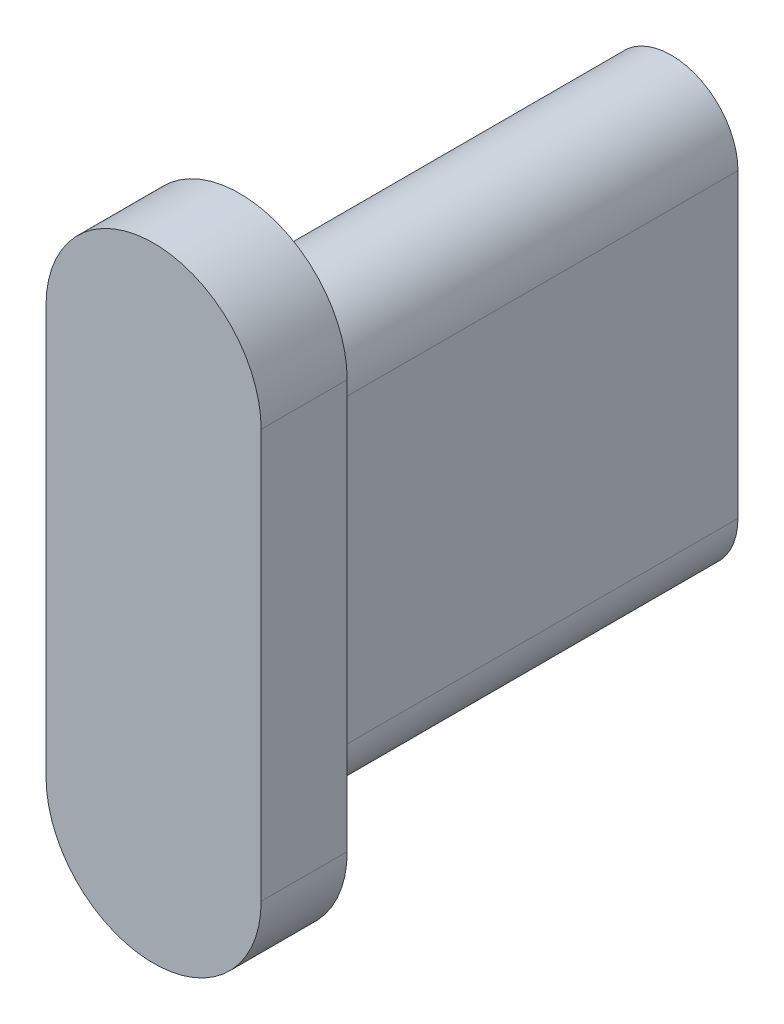
ISO-10303-21;
HEADER;
FILE_DESCRIPTION(('STEP AP214'),'2;1');
FILE_NAME('part.step','',(''),(''),'','','');
FILE_SCHEMA(('AUTOMOTIVE_DESIGN { 1 0 10303 214 1 1 1 1 }'));
ENDSEC;
DATA;
#1=APPLICATION_CONTEXT('core data for automotive mechanical design processes');
#2=APPLICATION_PROTOCOL_DEFINITION('international standard','automotive_design',2000,#1);
#3=PRODUCT_CONTEXT('',#1,'mechanical');
#4=PRODUCT('Part','Part','',(#3));
#5=PRODUCT_RELATED_PRODUCT_CATEGORY('part','',(#4));
#6=PRODUCT_DEFINITION_FORMATION('','',#4);
#7=PRODUCT_DEFINITION_CONTEXT('part definition',#1,'design');
#8=PRODUCT_DEFINITION('design','',#6,#7);
#9=PRODUCT_DEFINITION_SHAPE('','',#8);
#10=(LENGTH_UNIT() NAMED_UNIT(*) SI_UNIT(.MILLI.,.METRE.));
#11=(NAMED_UNIT(*) PLANE_ANGLE_UNIT() SI_UNIT($,.RADIAN.));
#12=(NAMED_UNIT(*) SI_UNIT($,.STERADIAN.) SOLID_ANGLE_UNIT());
#13=UNCERTAINTY_MEASURE_WITH_UNIT(LENGTH_MEASURE(1.E-05),#10,'distance_accuracy_value','');
#14=(GEOMETRIC_REPRESENTATION_CONTEXT(3) GLOBAL_UNCERTAINTY_ASSIGNED_CONTEXT((#13)) GLOBAL_UNIT_ASSIGNED_CONTEXT((#10,
#11,#12)) REPRESENTATION_CONTEXT('',''));
#15=CARTESIAN_POINT('',(0.,0.,0.));
#16=DIRECTION('',(0.,0.,1.));
#17=DIRECTION('',(1.,0.,0.));
#18=AXIS2_PLACEMENT_3D('',#15,#16,#17);
#19=CARTESIAN_POINT('',(0.0328598707184565,11.0177332614474,-10.));
#20=DIRECTION('',(0.,0.,1.));
#21=DIRECTION('',(1.,0.,0.));
#22=AXIS2_PLACEMENT_3D('',#19,#20,#21);
#23=CYLINDRICAL_SURFACE('',#22,1.55);
#24=CARTESIAN_POINT('',(0.0328598707184565,11.0177332614474,0.));
#25=DIRECTION('',(0.,0.,1.));
#26=DIRECTION('',(1.,0.,0.));
#27=AXIS2_PLACEMENT_3D('',#24,#25,#26);
#28=CIRCLE('',#27,1.55);
#29=CARTESIAN_POINT('',(1.58285987071845,11.0177332614475,0.));
#30=VERTEX_POINT('',#29);
#31=CARTESIAN_POINT('',(-1.51714012928155,11.0177332614475,0.));
#32=VERTEX_POINT('',#31);
#33=EDGE_CURVE('E186',#30,#32,#28,.T.);
#34=ORIENTED_EDGE('',*,*,#33,.F.);
#35=DIRECTION('',(0.,0.,1.));
#36=VECTOR('',#35,1.);
#37=CARTESIAN_POINT('',(1.58285987071845,11.0177332614475,-10.));
#38=LINE('',#37,#36);
#39=CARTESIAN_POINT('',(1.58285987071845,11.0177332614475,-10.));
#40=VERTEX_POINT('',#39);
#41=EDGE_CURVE('E11',#40,#30,#38,.T.);
#42=ORIENTED_EDGE('',*,*,#41,.F.);
#43=CARTESIAN_POINT('',(0.0328598707184565,11.0177332614474,-10.));
#44=DIRECTION('',(0.,0.,1.));
#45=DIRECTION('',(1.,0.,0.));
#46=AXIS2_PLACEMENT_3D('',#43,#44,#45);
#47=CIRCLE('',#46,1.55);
#48=CARTESIAN_POINT('',(-1.51714012928155,11.0177332614475,-10.));
#49=VERTEX_POINT('',#48);
#50=EDGE_CURVE('E194',#40,#49,#47,.T.);
#51=ORIENTED_EDGE('',*,*,#50,.T.);
#52=DIRECTION('',(0.,0.,1.));
#53=VECTOR('',#52,1.);
#54=CARTESIAN_POINT('',(-1.51714012928155,11.0177332614475,-10.));
#55=LINE('',#54,#53);
#56=EDGE_CURVE('E36',#49,#32,#55,.T.);
#57=ORIENTED_EDGE('',*,*,#56,.T.);
#58=EDGE_LOOP('',(#34,#42,#51,#57));
#59=FACE_BOUND('',#58,.T.);
#60=ADVANCED_FACE('F33',(#59),#23,.T.);
#61=CARTESIAN_POINT('',(1.58285987071845,4.01773326144746,-10.));
#62=DIRECTION('',(1.,0.,0.));
#63=DIRECTION('',(0.,1.,0.));
#64=AXIS2_PLACEMENT_3D('',#61,#62,#63);
#65=PLANE('',#64);
#66=DIRECTION('',(0.,1.,0.));
#67=VECTOR('',#66,1.);
#68=CARTESIAN_POINT('',(1.58285987071845,4.01773326144746,0.));
#69=LINE('',#68,#67);
#70=CARTESIAN_POINT('',(1.58285987071845,4.01773326144746,0.));
#71=VERTEX_POINT('',#70);
#72=EDGE_CURVE('E197',#71,#30,#69,.T.);
#73=ORIENTED_EDGE('',*,*,#72,.F.);
#74=DIRECTION('',(0.,0.,1.));
#75=VECTOR('',#74,1.);
#76=CARTESIAN_POINT('',(1.58285987071845,4.01773326144746,-10.));
#77=LINE('',#76,#75);
#78=CARTESIAN_POINT('',(1.58285987071845,4.01773326144746,-10.));
#79=VERTEX_POINT('',#78);
#80=EDGE_CURVE('E41',#79,#71,#77,.T.);
#81=ORIENTED_EDGE('',*,*,#80,.F.);
#82=DIRECTION('',(0.,1.,0.));
#83=VECTOR('',#82,1.);
#84=CARTESIAN_POINT('',(1.58285987071845,4.01773326144746,-10.));
#85=LINE('',#84,#83);
#86=EDGE_CURVE('E202',#79,#40,#85,.T.);
#87=ORIENTED_EDGE('',*,*,#86,.T.);
#88=ORIENTED_EDGE('',*,*,#41,.T.);
#89=EDGE_LOOP('',(#73,#81,#87,#88));
#90=FACE_BOUND('',#89,.T.);
#91=ADVANCED_FACE('F220',(#90),#65,.T.);
#92=CARTESIAN_POINT('',(0.0328598707184558,4.01773326144739,-10.));
#93=DIRECTION('',(0.,0.,1.));
#94=DIRECTION('',(1.,0.,0.));
#95=AXIS2_PLACEMENT_3D('',#92,#93,#94);
#96=CYLINDRICAL_SURFACE('',#95,1.55);
#97=CARTESIAN_POINT('',(0.0328598707184558,4.01773326144739,0.));
#98=DIRECTION('',(0.,0.,1.));
#99=DIRECTION('',(1.,0.,0.));
#100=AXIS2_PLACEMENT_3D('',#97,#98,#99);
#101=CIRCLE('',#100,1.55);
#102=CARTESIAN_POINT('',(-1.51714012928155,4.01773326144746,0.));
#103=VERTEX_POINT('',#102);
#104=EDGE_CURVE('E209',#103,#71,#101,.T.);
#105=ORIENTED_EDGE('',*,*,#104,.F.);
#106=DIRECTION('',(0.,0.,1.));
#107=VECTOR('',#106,1.);
#108=CARTESIAN_POINT('',(-1.51714012928155,4.01773326144746,-10.));
#109=LINE('',#108,#107);
#110=CARTESIAN_POINT('',(-1.51714012928155,4.01773326144746,-10.));
#111=VERTEX_POINT('',#110);
#112=EDGE_CURVE('E214',#111,#103,#109,.T.);
#113=ORIENTED_EDGE('',*,*,#112,.F.);
#114=CARTESIAN_POINT('',(0.0328598707184558,4.01773326144739,-10.));
#115=DIRECTION('',(0.,0.,1.));
#116=DIRECTION('',(1.,0.,0.));
#117=AXIS2_PLACEMENT_3D('',#114,#115,#116);
#118=CIRCLE('',#117,1.55);
#119=EDGE_CURVE('E199',#111,#79,#118,.T.);
#120=ORIENTED_EDGE('',*,*,#119,.T.);
#121=ORIENTED_EDGE('',*,*,#80,.T.);
#122=EDGE_LOOP('',(#105,#113,#120,#121));
#123=FACE_BOUND('',#122,.T.);
#124=ADVANCED_FACE('F224',(#123),#96,.T.);
#125=CARTESIAN_POINT('',(-1.51714012928155,11.0177332614475,-10.));
#126=DIRECTION('',(-1.,0.,0.));
#127=DIRECTION('',(0.,-1.,0.));
#128=AXIS2_PLACEMENT_3D('',#125,#126,#127);
#129=PLANE('',#128);
#130=DIRECTION('',(0.,-1.,0.));
#131=VECTOR('',#130,1.);
#132=CARTESIAN_POINT('',(-1.51714012928155,11.0177332614475,0.));
#133=LINE('',#132,#131);
#134=EDGE_CURVE('E206',#32,#103,#133,.T.);
#135=ORIENTED_EDGE('',*,*,#134,.F.);
#136=ORIENTED_EDGE('',*,*,#56,.F.);
#137=DIRECTION('',(0.,-1.,0.));
#138=VECTOR('',#137,1.);
#139=CARTESIAN_POINT('',(-1.51714012928155,11.0177332614475,-10.));
#140=LINE('',#139,#138);
#141=EDGE_CURVE('E196',#49,#111,#140,.T.);
#142=ORIENTED_EDGE('',*,*,#141,.T.);
#143=ORIENTED_EDGE('',*,*,#112,.T.);
#144=EDGE_LOOP('',(#135,#136,#142,#143));
#145=FACE_BOUND('',#144,.T.);
#146=ADVANCED_FACE('F216',(#145),#129,.T.);
#147=CARTESIAN_POINT('',(0.0328598707184565,11.0177332614474,-10.));
#148=DIRECTION('',(0.,0.,1.));
#149=DIRECTION('',(1.,0.,0.));
#150=AXIS2_PLACEMENT_3D('',#147,#148,#149);
#151=PLANE('',#150);
#152=DIRECTION('',(0.,1.,0.));
#153=VECTOR('',#152,1.);
#154=CARTESIAN_POINT('',(0.58285987071845,4.01773326144746,-10.));
#155=LINE('',#154,#153);
#156=CARTESIAN_POINT('',(0.58285987071845,4.01773326144746,-10.));
#157=VERTEX_POINT('',#156);
#158=CARTESIAN_POINT('',(0.582859870718453,11.0177332614475,-10.));
#159=VERTEX_POINT('',#158);
#160=EDGE_CURVE('E172',#157,#159,#155,.T.);
#161=ORIENTED_EDGE('',*,*,#160,.T.);
#162=CARTESIAN_POINT('',(0.0328598707184521,11.0177332614475,-10.));
#163=DIRECTION('',(0.,0.,1.));
#164=DIRECTION('',(1.,0.,0.));
#165=AXIS2_PLACEMENT_3D('',#162,#163,#164);
#166=CIRCLE('',#165,0.55);
#167=CARTESIAN_POINT('',(-0.517140129281548,11.0177332614475,-10.));
#168=VERTEX_POINT('',#167);
#169=EDGE_CURVE('E164',#159,#168,#166,.T.);
#170=ORIENTED_EDGE('',*,*,#169,.T.);
#171=DIRECTION('',(0.,-1.,0.));
#172=VECTOR('',#171,1.);
#173=CARTESIAN_POINT('',(-0.517140129281548,11.0177332614475,-10.));
#174=LINE('',#173,#172);
#175=CARTESIAN_POINT('',(-0.517140129281549,4.01773326144746,-10.));
#176=VERTEX_POINT('',#175);
#177=EDGE_CURVE('E167',#168,#176,#174,.T.);
#178=ORIENTED_EDGE('',*,*,#177,.T.);
#179=CARTESIAN_POINT('',(0.0328598707184497,4.01773326144745,-10.));
#180=DIRECTION('',(0.,0.,1.));
#181=DIRECTION('',(1.,0.,0.));
#182=AXIS2_PLACEMENT_3D('',#179,#180,#181);
#183=CIRCLE('',#182,0.55);
#184=EDGE_CURVE('E49',#176,#157,#183,.T.);
#185=ORIENTED_EDGE('',*,*,#184,.T.);
#186=EDGE_LOOP('',(#161,#170,#178,#185));
#187=FACE_BOUND('',#186,.T.);
#188=ORIENTED_EDGE('',*,*,#50,.F.);
#189=ORIENTED_EDGE('',*,*,#86,.F.);
#190=ORIENTED_EDGE('',*,*,#119,.F.);
#191=ORIENTED_EDGE('',*,*,#141,.F.);
#192=EDGE_LOOP('',(#188,#189,#190,#191));
#193=FACE_BOUND('',#192,.T.);
#194=ADVANCED_FACE('F226',(#187,#193),#151,.F.);
#195=CARTESIAN_POINT('',(0.0328598707184521,11.0177332614475,-10.));
#196=DIRECTION('',(0.,0.,1.));
#197=DIRECTION('',(1.,0.,0.));
#198=AXIS2_PLACEMENT_3D('',#195,#196,#197);
#199=CYLINDRICAL_SURFACE('',#198,0.55);
#200=CARTESIAN_POINT('',(0.0328598707184521,11.0177332614475,0.));
#201=DIRECTION('',(0.,0.,1.));
#202=DIRECTION('',(1.,0.,0.));
#203=AXIS2_PLACEMENT_3D('',#200,#201,#202);
#204=CIRCLE('',#203,0.55);
#205=CARTESIAN_POINT('',(0.582859870718453,11.0177332614475,0.));
#206=VERTEX_POINT('',#205);
#207=CARTESIAN_POINT('',(-0.517140129281548,11.0177332614475,0.));
#208=VERTEX_POINT('',#207);
#209=EDGE_CURVE('E155',#206,#208,#204,.T.);
#210=ORIENTED_EDGE('',*,*,#209,.T.);
#211=DIRECTION('',(0.,0.,1.));
#212=VECTOR('',#211,1.);
#213=CARTESIAN_POINT('',(-0.517140129281548,11.0177332614475,-10.));
#214=LINE('',#213,#212);
#215=EDGE_CURVE('E174',#168,#208,#214,.T.);
#216=ORIENTED_EDGE('',*,*,#215,.F.);
#217=ORIENTED_EDGE('',*,*,#169,.F.);
#218=DIRECTION('',(0.,0.,1.));
#219=VECTOR('',#218,1.);
#220=CARTESIAN_POINT('',(0.582859870718453,11.0177332614475,-10.));
#221=LINE('',#220,#219);
#222=EDGE_CURVE('E183',#159,#206,#221,.T.);
#223=ORIENTED_EDGE('',*,*,#222,.T.);
#224=EDGE_LOOP('',(#210,#216,#217,#223));
#225=FACE_BOUND('',#224,.T.);
#226=ADVANCED_FACE('F228',(#225),#199,.F.);
#227=CARTESIAN_POINT('',(0.58285987071845,4.01773326144746,-10.));
#228=DIRECTION('',(1.,0.,0.));
#229=DIRECTION('',(0.,1.,0.));
#230=AXIS2_PLACEMENT_3D('',#227,#228,#229);
#231=PLANE('',#230);
#232=DIRECTION('',(0.,1.,0.));
#233=VECTOR('',#232,1.);
#234=CARTESIAN_POINT('',(0.58285987071845,4.01773326144746,0.));
#235=LINE('',#234,#233);
#236=CARTESIAN_POINT('',(0.582859870718449,4.01773326144745,0.));
#237=VERTEX_POINT('',#236);
#238=EDGE_CURVE('E168',#237,#206,#235,.T.);
#239=ORIENTED_EDGE('',*,*,#238,.T.);
#240=ORIENTED_EDGE('',*,*,#222,.F.);
#241=ORIENTED_EDGE('',*,*,#160,.F.);
#242=DIRECTION('',(0.,0.,1.));
#243=VECTOR('',#242,1.);
#244=CARTESIAN_POINT('',(0.58285987071845,4.01773326144746,-10.));
#245=LINE('',#244,#243);
#246=EDGE_CURVE('E187',#157,#237,#245,.T.);
#247=ORIENTED_EDGE('',*,*,#246,.T.);
#248=EDGE_LOOP('',(#239,#240,#241,#247));
#249=FACE_BOUND('',#248,.T.);
#250=ADVANCED_FACE('F235',(#249),#231,.F.);
#251=CARTESIAN_POINT('',(0.0328598707184497,4.01773326144745,-10.));
#252=DIRECTION('',(0.,0.,1.));
#253=DIRECTION('',(1.,0.,0.));
#254=AXIS2_PLACEMENT_3D('',#251,#252,#253);
#255=CYLINDRICAL_SURFACE('',#254,0.55);
#256=CARTESIAN_POINT('',(0.0328598707184497,4.01773326144745,0.));
#257=DIRECTION('',(0.,0.,1.));
#258=DIRECTION('',(1.,0.,0.));
#259=AXIS2_PLACEMENT_3D('',#256,#257,#258);
#260=CIRCLE('',#259,0.55);
#261=CARTESIAN_POINT('',(-0.51714012928155,4.01773326144746,0.));
#262=VERTEX_POINT('',#261);
#263=EDGE_CURVE('E178',#262,#237,#260,.T.);
#264=ORIENTED_EDGE('',*,*,#263,.T.);
#265=ORIENTED_EDGE('',*,*,#246,.F.);
#266=ORIENTED_EDGE('',*,*,#184,.F.);
#267=DIRECTION('',(0.,0.,1.));
#268=VECTOR('',#267,1.);
#269=CARTESIAN_POINT('',(-0.51714012928155,4.01773326144746,-10.));
#270=LINE('',#269,#268);
#271=EDGE_CURVE('E190',#176,#262,#270,.T.);
#272=ORIENTED_EDGE('',*,*,#271,.T.);
#273=EDGE_LOOP('',(#264,#265,#266,#272));
#274=FACE_BOUND('',#273,.T.);
#275=ADVANCED_FACE('F269',(#274),#255,.F.);
#276=CARTESIAN_POINT('',(-0.517140129281548,11.0177332614475,-10.));
#277=DIRECTION('',(-1.,0.,0.));
#278=DIRECTION('',(0.,-1.,0.));
#279=AXIS2_PLACEMENT_3D('',#276,#277,#278);
#280=PLANE('',#279);
#281=DIRECTION('',(0.,-1.,0.));
#282=VECTOR('',#281,1.);
#283=CARTESIAN_POINT('',(-0.517140129281548,11.0177332614475,0.));
#284=LINE('',#283,#282);
#285=EDGE_CURVE('E158',#208,#262,#284,.T.);
#286=ORIENTED_EDGE('',*,*,#285,.T.);
#287=ORIENTED_EDGE('',*,*,#271,.F.);
#288=ORIENTED_EDGE('',*,*,#177,.F.);
#289=ORIENTED_EDGE('',*,*,#215,.T.);
#290=EDGE_LOOP('',(#286,#287,#288,#289));
#291=FACE_BOUND('',#290,.T.);
#292=ADVANCED_FACE('F279',(#291),#280,.F.);
#293=CARTESIAN_POINT('',(0.,2.76773326144739,0.));
#294=DIRECTION('',(0.,0.,1.));
#295=DIRECTION('',(1.,0.,0.));
#296=AXIS2_PLACEMENT_3D('',#293,#294,#295);
#297=PLANE('',#296);
#298=ORIENTED_EDGE('',*,*,#285,.F.);
#299=ORIENTED_EDGE('',*,*,#209,.F.);
#300=ORIENTED_EDGE('',*,*,#238,.F.);
#301=ORIENTED_EDGE('',*,*,#263,.F.);
#302=EDGE_LOOP('',(#298,#299,#300,#301));
#303=FACE_BOUND('',#302,.T.);
#304=ADVANCED_FACE('F288',(#303),#297,.F.);
#305=CARTESIAN_POINT('',(0.,2.76773326144739,2.));
#306=DIRECTION('',(0.,0.,-1.));
#307=DIRECTION('',(-1.,0.,0.));
#308=AXIS2_PLACEMENT_3D('',#305,#306,#307);
#309=CYLINDRICAL_SURFACE('',#308,2.5);
#310=CARTESIAN_POINT('',(0.,2.76773326144739,0.));
#311=DIRECTION('',(0.,0.,1.));
#312=DIRECTION('',(1.,0.,0.));
#313=AXIS2_PLACEMENT_3D('',#310,#311,#312);
#314=CIRCLE('',#313,2.5);
#315=CARTESIAN_POINT('',(-2.5,2.76773326144739,0.));
#316=VERTEX_POINT('',#315);
#317=CARTESIAN_POINT('',(2.5,2.76773326144739,0.));
#318=VERTEX_POINT('',#317);
#319=EDGE_CURVE('E154',#316,#318,#314,.T.);
#320=ORIENTED_EDGE('',*,*,#319,.T.);
#321=DIRECTION('',(0.,0.,-1.));
#322=VECTOR('',#321,1.);
#323=CARTESIAN_POINT('',(2.5,2.76773326144739,2.));
#324=LINE('',#323,#322);
#325=CARTESIAN_POINT('',(2.5,2.76773326144739,2.));
#326=VERTEX_POINT('',#325);
#327=EDGE_CURVE('E134',#326,#318,#324,.T.);
#328=ORIENTED_EDGE('',*,*,#327,.F.);
#329=CARTESIAN_POINT('',(0.,2.76773326144739,2.));
#330=DIRECTION('',(0.,0.,1.));
#331=DIRECTION('',(1.,0.,0.));
#332=AXIS2_PLACEMENT_3D('',#329,#330,#331);
#333=CIRCLE('',#332,2.5);
#334=CARTESIAN_POINT('',(-2.5,2.76773326144739,2.));
#335=VERTEX_POINT('',#334);
#336=EDGE_CURVE('E141',#335,#326,#333,.T.);
#337=ORIENTED_EDGE('',*,*,#336,.F.);
#338=DIRECTION('',(0.,0.,-1.));
#339=VECTOR('',#338,1.);
#340=CARTESIAN_POINT('',(-2.5,2.76773326144739,2.));
#341=LINE('',#340,#339);
#342=EDGE_CURVE('E355',#335,#316,#341,.T.);
#343=ORIENTED_EDGE('',*,*,#342,.T.);
#344=EDGE_LOOP('',(#320,#328,#337,#343));
#345=FACE_BOUND('',#344,.T.);
#346=ADVANCED_FACE('F152',(#345),#309,.T.);
#347=CARTESIAN_POINT('',(2.5,2.76773326144739,2.));
#348=DIRECTION('',(-1.,0.,0.));
#349=DIRECTION('',(0.,-1.,0.));
#350=AXIS2_PLACEMENT_3D('',#347,#348,#349);
#351=PLANE('',#350);
#352=DIRECTION('',(0.,1.,0.));
#353=VECTOR('',#352,1.);
#354=CARTESIAN_POINT('',(2.5,2.76773326144739,0.));
#355=LINE('',#354,#353);
#356=CARTESIAN_POINT('',(2.5,12.2677332614474,0.));
#357=VERTEX_POINT('',#356);
#358=EDGE_CURVE('E361',#318,#357,#355,.T.);
#359=ORIENTED_EDGE('',*,*,#358,.T.);
#360=DIRECTION('',(0.,0.,-1.));
#361=VECTOR('',#360,1.);
#362=CARTESIAN_POINT('',(2.5,12.2677332614474,2.));
#363=LINE('',#362,#361);
#364=CARTESIAN_POINT('',(2.5,12.2677332614474,2.));
#365=VERTEX_POINT('',#364);
#366=EDGE_CURVE('E137',#365,#357,#363,.T.);
#367=ORIENTED_EDGE('',*,*,#366,.F.);
#368=DIRECTION('',(0.,1.,0.));
#369=VECTOR('',#368,1.);
#370=CARTESIAN_POINT('',(2.5,2.76773326144739,2.));
#371=LINE('',#370,#369);
#372=EDGE_CURVE('E130',#326,#365,#371,.T.);
#373=ORIENTED_EDGE('',*,*,#372,.F.);
#374=ORIENTED_EDGE('',*,*,#327,.T.);
#375=EDGE_LOOP('',(#359,#367,#373,#374));
#376=FACE_BOUND('',#375,.T.);
#377=ADVANCED_FACE('F132',(#376),#351,.F.);
#378=CARTESIAN_POINT('',(0.,12.2677332614474,2.));
#379=DIRECTION('',(0.,0.,-1.));
#380=DIRECTION('',(-1.,0.,0.));
#381=AXIS2_PLACEMENT_3D('',#378,#379,#380);
#382=CYLINDRICAL_SURFACE('',#381,2.5);
#383=CARTESIAN_POINT('',(0.,12.2677332614474,0.));
#384=DIRECTION('',(0.,0.,1.));
#385=DIRECTION('',(1.,0.,0.));
#386=AXIS2_PLACEMENT_3D('',#383,#384,#385);
#387=CIRCLE('',#386,2.5);
#388=CARTESIAN_POINT('',(-2.5,12.2677332614474,0.));
#389=VERTEX_POINT('',#388);
#390=EDGE_CURVE('E358',#357,#389,#387,.T.);
#391=ORIENTED_EDGE('',*,*,#390,.T.);
#392=DIRECTION('',(0.,0.,-1.));
#393=VECTOR('',#392,1.);
#394=CARTESIAN_POINT('',(-2.5,12.2677332614474,2.));
#395=LINE('',#394,#393);
#396=CARTESIAN_POINT('',(-2.5,12.2677332614474,2.));
#397=VERTEX_POINT('',#396);
#398=EDGE_CURVE('E160',#397,#389,#395,.T.);
#399=ORIENTED_EDGE('',*,*,#398,.F.);
#400=CARTESIAN_POINT('',(0.,12.2677332614474,2.));
#401=DIRECTION('',(0.,0.,1.));
#402=DIRECTION('',(1.,0.,0.));
#403=AXIS2_PLACEMENT_3D('',#400,#401,#402);
#404=CIRCLE('',#403,2.5);
#405=EDGE_CURVE('E140',#365,#397,#404,.T.);
#406=ORIENTED_EDGE('',*,*,#405,.F.);
#407=ORIENTED_EDGE('',*,*,#366,.T.);
#408=EDGE_LOOP('',(#391,#399,#406,#407));
#409=FACE_BOUND('',#408,.T.);
#410=ADVANCED_FACE('F315',(#409),#382,.T.);
#411=CARTESIAN_POINT('',(-2.5,2.76773326144739,2.));
#412=DIRECTION('',(1.,0.,0.));
#413=DIRECTION('',(0.,1.,0.));
#414=AXIS2_PLACEMENT_3D('',#411,#412,#413);
#415=PLANE('',#414);
#416=DIRECTION('',(0.,-1.,0.));
#417=VECTOR('',#416,1.);
#418=CARTESIAN_POINT('',(-2.5,2.76773326144739,0.));
#419=LINE('',#418,#417);
#420=EDGE_CURVE('E150',#389,#316,#419,.T.);
#421=ORIENTED_EDGE('',*,*,#420,.T.);
#422=ORIENTED_EDGE('',*,*,#342,.F.);
#423=DIRECTION('',(0.,-1.,0.));
#424=VECTOR('',#423,1.);
#425=CARTESIAN_POINT('',(-2.5,2.76773326144739,2.));
#426=LINE('',#425,#424);
#427=EDGE_CURVE('E146',#397,#335,#426,.T.);
#428=ORIENTED_EDGE('',*,*,#427,.F.);
#429=ORIENTED_EDGE('',*,*,#398,.T.);
#430=EDGE_LOOP('',(#421,#422,#428,#429));
#431=FACE_BOUND('',#430,.T.);
#432=ADVANCED_FACE('F324',(#431),#415,.F.);
#433=CARTESIAN_POINT('',(0.,2.76773326144739,2.));
#434=DIRECTION('',(0.,0.,1.));
#435=DIRECTION('',(1.,0.,0.));
#436=AXIS2_PLACEMENT_3D('',#433,#434,#435);
#437=PLANE('',#436);
#438=ORIENTED_EDGE('',*,*,#336,.T.);
#439=ORIENTED_EDGE('',*,*,#372,.T.);
#440=ORIENTED_EDGE('',*,*,#405,.T.);
#441=ORIENTED_EDGE('',*,*,#427,.T.);
#442=EDGE_LOOP('',(#438,#439,#440,#441));
#443=FACE_BOUND('',#442,.T.);
#444=ADVANCED_FACE('F144',(#443),#437,.T.);
#445=ORIENTED_EDGE('',*,*,#33,.T.);
#446=ORIENTED_EDGE('',*,*,#134,.T.);
#447=ORIENTED_EDGE('',*,*,#104,.T.);
#448=ORIENTED_EDGE('',*,*,#72,.T.);
#449=EDGE_LOOP('',(#445,#446,#447,#448));
#450=FACE_BOUND('',#449,.T.);
#451=ORIENTED_EDGE('',*,*,#319,.F.);
#452=ORIENTED_EDGE('',*,*,#420,.F.);
#453=ORIENTED_EDGE('',*,*,#390,.F.);
#454=ORIENTED_EDGE('',*,*,#358,.F.);
#455=EDGE_LOOP('',(#451,#452,#453,#454));
#456=FACE_BOUND('',#455,.T.);
#457=ADVANCED_FACE('F218',(#450,#456),#297,.F.);
#458=CLOSED_SHELL('',(#60,#91,#124,#146,#194,#226,#250,#275,#292,#304,#346,#377,#410,#432,#444,#457));
#459=MANIFOLD_SOLID_BREP('B2',#458);
#460=ADVANCED_BREP_SHAPE_REPRESENTATION('',(#18,#459),#14);
#461=SHAPE_DEFINITION_REPRESENTATION(#9,#460);
ENDSEC;
END-ISO-10303-21;
